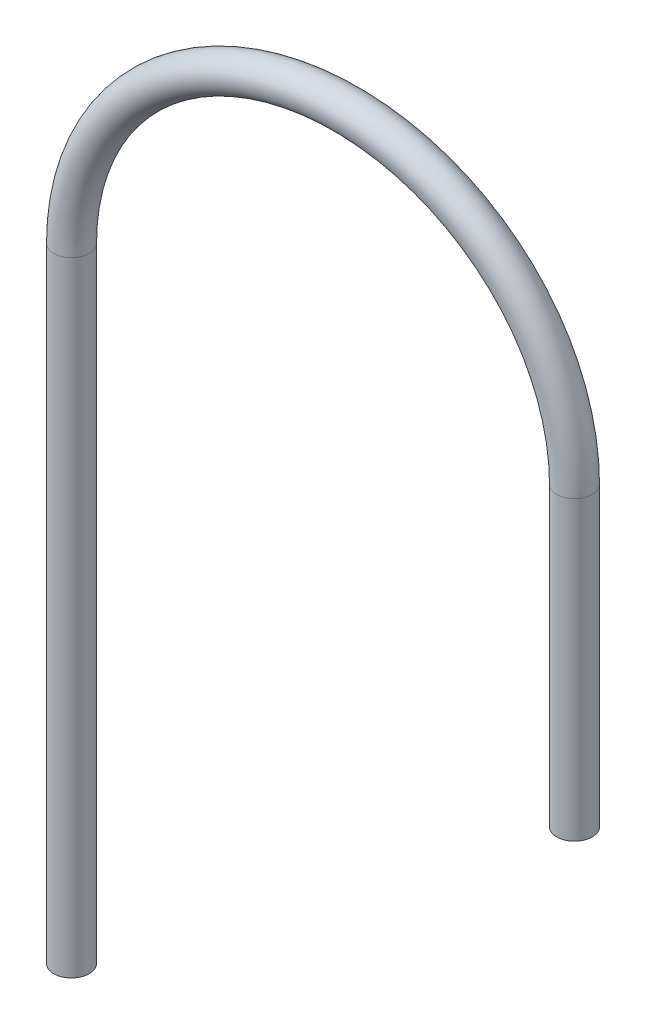
ISO-10303-21;
HEADER;
FILE_DESCRIPTION(('STEP AP214'),'2;1');
FILE_NAME('part.step','',(''),(''),'','','');
FILE_SCHEMA(('AUTOMOTIVE_DESIGN { 1 0 10303 214 1 1 1 1 }'));
ENDSEC;
DATA;
#1=APPLICATION_CONTEXT('core data for automotive mechanical design processes');
#2=APPLICATION_PROTOCOL_DEFINITION('international standard','automotive_design',2000,#1);
#3=PRODUCT_CONTEXT('',#1,'mechanical');
#4=PRODUCT('Part','Part','',(#3));
#5=PRODUCT_RELATED_PRODUCT_CATEGORY('part','',(#4));
#6=PRODUCT_DEFINITION_FORMATION('','',#4);
#7=PRODUCT_DEFINITION_CONTEXT('part definition',#1,'design');
#8=PRODUCT_DEFINITION('design','',#6,#7);
#9=PRODUCT_DEFINITION_SHAPE('','',#8);
#10=(LENGTH_UNIT() NAMED_UNIT(*) SI_UNIT(.MILLI.,.METRE.));
#11=(NAMED_UNIT(*) PLANE_ANGLE_UNIT() SI_UNIT($,.RADIAN.));
#12=(NAMED_UNIT(*) SI_UNIT($,.STERADIAN.) SOLID_ANGLE_UNIT());
#13=UNCERTAINTY_MEASURE_WITH_UNIT(LENGTH_MEASURE(1.E-05),#10,'distance_accuracy_value','');
#14=(GEOMETRIC_REPRESENTATION_CONTEXT(3) GLOBAL_UNCERTAINTY_ASSIGNED_CONTEXT((#13)) GLOBAL_UNIT_ASSIGNED_CONTEXT((#10,
#11,#12)) REPRESENTATION_CONTEXT('',''));
#15=CARTESIAN_POINT('',(0.,0.,0.));
#16=DIRECTION('',(0.,0.,1.));
#17=DIRECTION('',(1.,0.,0.));
#18=AXIS2_PLACEMENT_3D('',#15,#16,#17);
#19=CARTESIAN_POINT('',(42.,165.,-59.25));
#20=DIRECTION('',(0.,-1.,0.));
#21=DIRECTION('',(0.184305138259408,0.,0.982869073687427));
#22=AXIS2_PLACEMENT_3D('',#19,#20,#21);
#23=PLANE('',#22);
#24=CARTESIAN_POINT('',(42.,165.,-59.25));
#25=DIRECTION('',(0.,-1.,0.));
#26=DIRECTION('',(0.,0.,-1.));
#27=AXIS2_PLACEMENT_3D('',#24,#25,#26);
#28=CIRCLE('',#27,2.);
#29=CARTESIAN_POINT('',(42.,165.,-61.25));
#30=VERTEX_POINT('',#29);
#31=EDGE_CURVE('E66',#30,#30,#28,.T.);
#32=ORIENTED_EDGE('',*,*,#31,.F.);
#33=EDGE_LOOP('',(#32));
#34=FACE_BOUND('',#33,.T.);
#35=CARTESIAN_POINT('',(42.,165.,-59.25));
#36=DIRECTION('',(0.,-1.,0.));
#37=DIRECTION('',(0.184305138259408,0.,0.982869073687427));
#38=AXIS2_PLACEMENT_3D('',#35,#36,#37);
#39=CIRCLE('',#38,3.);
#40=CARTESIAN_POINT('',(42.5529154147782,165.,-56.3013927789377));
#41=VERTEX_POINT('',#40);
#42=EDGE_CURVE('E57',#41,#41,#39,.T.);
#43=ORIENTED_EDGE('',*,*,#42,.T.);
#44=EDGE_LOOP('',(#43));
#45=FACE_BOUND('',#44,.T.);
#46=ADVANCED_FACE('F43',(#34,#45),#23,.T.);
#47=CARTESIAN_POINT('',(-36.,109.55,-52.));
#48=DIRECTION('',(0.,1.,0.));
#49=DIRECTION('',(0.,0.,1.));
#50=AXIS2_PLACEMENT_3D('',#47,#48,#49);
#51=PLANE('',#50);
#52=CARTESIAN_POINT('',(-36.,109.55,-52.));
#53=DIRECTION('',(0.,1.,0.));
#54=DIRECTION('',(0.,0.,1.));
#55=AXIS2_PLACEMENT_3D('',#52,#53,#54);
#56=CIRCLE('',#55,2.);
#57=CARTESIAN_POINT('',(-36.,109.55,-50.));
#58=VERTEX_POINT('',#57);
#59=EDGE_CURVE('E62',#58,#58,#56,.T.);
#60=ORIENTED_EDGE('',*,*,#59,.T.);
#61=EDGE_LOOP('',(#60));
#62=FACE_BOUND('',#61,.T.);
#63=CARTESIAN_POINT('',(-36.,109.55,-52.));
#64=DIRECTION('',(0.,1.,0.));
#65=DIRECTION('',(0.,0.,1.));
#66=AXIS2_PLACEMENT_3D('',#63,#64,#65);
#67=CIRCLE('',#66,3.);
#68=CARTESIAN_POINT('',(-36.,109.55,-49.));
#69=VERTEX_POINT('',#68);
#70=EDGE_CURVE('E11',#69,#69,#67,.T.);
#71=ORIENTED_EDGE('',*,*,#70,.F.);
#72=EDGE_LOOP('',(#71));
#73=FACE_BOUND('',#72,.T.);
#74=ADVANCED_FACE('F86',(#62,#73),#51,.F.);
#75=CARTESIAN_POINT('',(42.,165.,-59.25));
#76=DIRECTION('',(0.,1.,0.));
#77=DIRECTION('',(0.,0.,1.));
#78=AXIS2_PLACEMENT_3D('',#75,#76,#77);
#79=CYLINDRICAL_SURFACE('',#78,3.);
#80=CARTESIAN_POINT('',(42.,215.275,-59.25));
#81=DIRECTION('',(0.,-1.,0.));
#82=DIRECTION('',(0.184305138259408,0.,0.982869073687427));
#83=AXIS2_PLACEMENT_3D('',#80,#81,#82);
#84=CIRCLE('',#83,3.);
#85=CARTESIAN_POINT('',(44.9871241741169,215.275,-59.5276493623378));
#86=VERTEX_POINT('',#85);
#87=EDGE_CURVE('E53',#86,#86,#84,.T.);
#88=ORIENTED_EDGE('',*,*,#87,.T.);
#89=EDGE_LOOP('',(#88));
#90=FACE_BOUND('',#89,.T.);
#91=ORIENTED_EDGE('',*,*,#42,.F.);
#92=EDGE_LOOP('',(#91));
#93=FACE_BOUND('',#92,.T.);
#94=ADVANCED_FACE('F90',(#90,#93),#79,.T.);
#95=CARTESIAN_POINT('',(3.,215.275,-55.625));
#96=DIRECTION('',(0.0925497874459288,0.,0.995708058038958));
#97=DIRECTION('',(0.995708058038958,0.,-0.0925497874459288));
#98=AXIS2_PLACEMENT_3D('',#95,#96,#97);
#99=TOROIDAL_SURFACE('',#98,39.1681072430109,3.);
#100=CARTESIAN_POINT('',(-36.,215.275,-52.));
#101=DIRECTION('',(0.,1.,0.));
#102=DIRECTION('',(0.,0.,1.));
#103=AXIS2_PLACEMENT_3D('',#100,#101,#102);
#104=CIRCLE('',#103,3.);
#105=CARTESIAN_POINT('',(-38.9871241741169,215.275,-51.7223506376622));
#106=VERTEX_POINT('',#105);
#107=EDGE_CURVE('E49',#106,#106,#104,.T.);
#108=CARTESIAN_POINT('',(3.,215.275,-55.625));
#109=DIRECTION('',(0.0925497874459288,0.,0.995708058038958));
#110=DIRECTION('',(0.995708058038958,0.,-0.0925497874459288));
#111=AXIS2_PLACEMENT_3D('',#108,#109,#110);
#112=CIRCLE('',#111,42.1681072430109);
#113=EDGE_CURVE('',#86,#106,#112,.T.);
#114=ORIENTED_EDGE('',*,*,#87,.F.);
#115=ORIENTED_EDGE('',*,*,#107,.T.);
#116=ORIENTED_EDGE('',*,*,#113,.T.);
#117=ORIENTED_EDGE('',*,*,#113,.F.);
#118=EDGE_LOOP('',(#114,#116,#115,#117));
#119=FACE_BOUND('',#118,.T.);
#120=ADVANCED_FACE('F92',(#119),#99,.T.);
#121=CARTESIAN_POINT('',(-36.,215.275,-52.));
#122=DIRECTION('',(0.,-1.,0.));
#123=DIRECTION('',(0.,0.,-1.));
#124=AXIS2_PLACEMENT_3D('',#121,#122,#123);
#125=CYLINDRICAL_SURFACE('',#124,3.);
#126=ORIENTED_EDGE('',*,*,#70,.T.);
#127=EDGE_LOOP('',(#126));
#128=FACE_BOUND('',#127,.T.);
#129=ORIENTED_EDGE('',*,*,#107,.F.);
#130=EDGE_LOOP('',(#129));
#131=FACE_BOUND('',#130,.T.);
#132=ADVANCED_FACE('F80',(#128,#131),#125,.T.);
#133=CARTESIAN_POINT('',(42.,165.,-59.25));
#134=DIRECTION('',(0.,1.,0.));
#135=DIRECTION('',(0.,0.,1.));
#136=AXIS2_PLACEMENT_3D('',#133,#134,#135);
#137=CYLINDRICAL_SURFACE('',#136,2.);
#138=CARTESIAN_POINT('',(42.,215.275,-59.25));
#139=DIRECTION('',(0.,1.,0.));
#140=DIRECTION('',(0.,0.,1.));
#141=AXIS2_PLACEMENT_3D('',#138,#139,#140);
#142=CIRCLE('',#141,2.);
#143=CARTESIAN_POINT('',(43.9914161160779,215.275,-59.4350995748919));
#144=VERTEX_POINT('',#143);
#145=EDGE_CURVE('E69',#144,#144,#142,.F.);
#146=ORIENTED_EDGE('',*,*,#145,.F.);
#147=EDGE_LOOP('',(#146));
#148=FACE_BOUND('',#147,.T.);
#149=ORIENTED_EDGE('',*,*,#31,.T.);
#150=EDGE_LOOP('',(#149));
#151=FACE_BOUND('',#150,.T.);
#152=ADVANCED_FACE('F77',(#148,#151),#137,.F.);
#153=CARTESIAN_POINT('',(3.,215.275,-55.625));
#154=DIRECTION('',(0.0925497874459288,0.,0.995708058038958));
#155=DIRECTION('',(0.995708058038958,0.,-0.0925497874459288));
#156=AXIS2_PLACEMENT_3D('',#153,#154,#155);
#157=TOROIDAL_SURFACE('',#156,39.1681072430109,2.);
#158=CARTESIAN_POINT('',(-36.,215.275,-52.));
#159=DIRECTION('',(0.,1.,0.));
#160=DIRECTION('',(-1.,0.,0.));
#161=AXIS2_PLACEMENT_3D('',#158,#159,#160);
#162=CIRCLE('',#161,2.);
#163=CARTESIAN_POINT('',(-37.9914161160779,215.275,-51.8149004251081));
#164=VERTEX_POINT('',#163);
#165=EDGE_CURVE('E65',#164,#164,#162,.T.);
#166=CARTESIAN_POINT('',(3.,215.275,-55.625));
#167=DIRECTION('',(0.0925497874459288,0.,0.995708058038958));
#168=DIRECTION('',(0.995708058038958,0.,-0.0925497874459288));
#169=AXIS2_PLACEMENT_3D('',#166,#167,#168);
#170=CIRCLE('',#169,41.1681072430109);
#171=EDGE_CURVE('',#144,#164,#170,.T.);
#172=ORIENTED_EDGE('',*,*,#145,.T.);
#173=ORIENTED_EDGE('',*,*,#165,.F.);
#174=ORIENTED_EDGE('',*,*,#171,.T.);
#175=ORIENTED_EDGE('',*,*,#171,.F.);
#176=EDGE_LOOP('',(#172,#174,#173,#175));
#177=FACE_BOUND('',#176,.T.);
#178=ADVANCED_FACE('F75',(#177),#157,.F.);
#179=CARTESIAN_POINT('',(-36.,215.275,-52.));
#180=DIRECTION('',(0.,-1.,0.));
#181=DIRECTION('',(0.,0.,-1.));
#182=AXIS2_PLACEMENT_3D('',#179,#180,#181);
#183=CYLINDRICAL_SURFACE('',#182,2.);
#184=ORIENTED_EDGE('',*,*,#59,.F.);
#185=EDGE_LOOP('',(#184));
#186=FACE_BOUND('',#185,.T.);
#187=ORIENTED_EDGE('',*,*,#165,.T.);
#188=EDGE_LOOP('',(#187));
#189=FACE_BOUND('',#188,.T.);
#190=ADVANCED_FACE('F87',(#186,#189),#183,.F.);
#191=CLOSED_SHELL('',(#46,#74,#94,#120,#132,#152,#178,#190));
#192=MANIFOLD_SOLID_BREP('B2',#191);
#193=ADVANCED_BREP_SHAPE_REPRESENTATION('',(#18,#192),#14);
#194=SHAPE_DEFINITION_REPRESENTATION(#9,#193);
ENDSEC;
END-ISO-10303-21;
